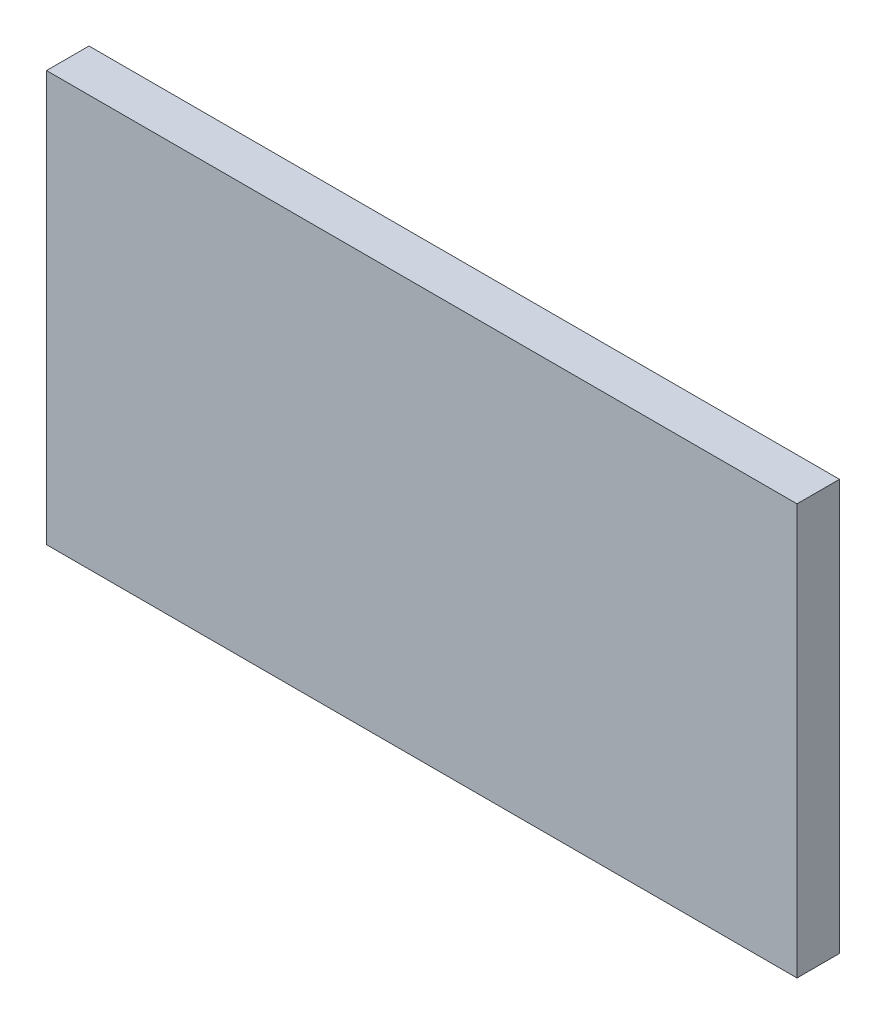
ISO-10303-21;
HEADER;
FILE_DESCRIPTION(('STEP AP214'),'2;1');
FILE_NAME('part.step','',(''),(''),'','','');
FILE_SCHEMA(('AUTOMOTIVE_DESIGN { 1 0 10303 214 1 1 1 1 }'));
ENDSEC;
DATA;
#1=APPLICATION_CONTEXT('core data for automotive mechanical design processes');
#2=APPLICATION_PROTOCOL_DEFINITION('international standard','automotive_design',2000,#1);
#3=PRODUCT_CONTEXT('',#1,'mechanical');
#4=PRODUCT('Part','Part','',(#3));
#5=PRODUCT_RELATED_PRODUCT_CATEGORY('part','',(#4));
#6=PRODUCT_DEFINITION_FORMATION('','',#4);
#7=PRODUCT_DEFINITION_CONTEXT('part definition',#1,'design');
#8=PRODUCT_DEFINITION('design','',#6,#7);
#9=PRODUCT_DEFINITION_SHAPE('','',#8);
#10=(LENGTH_UNIT() NAMED_UNIT(*) SI_UNIT(.MILLI.,.METRE.));
#11=(NAMED_UNIT(*) PLANE_ANGLE_UNIT() SI_UNIT($,.RADIAN.));
#12=(NAMED_UNIT(*) SI_UNIT($,.STERADIAN.) SOLID_ANGLE_UNIT());
#13=UNCERTAINTY_MEASURE_WITH_UNIT(LENGTH_MEASURE(1.E-05),#10,'distance_accuracy_value','');
#14=(GEOMETRIC_REPRESENTATION_CONTEXT(3) GLOBAL_UNCERTAINTY_ASSIGNED_CONTEXT((#13)) GLOBAL_UNIT_ASSIGNED_CONTEXT((#10,
#11,#12)) REPRESENTATION_CONTEXT('',''));
#15=CARTESIAN_POINT('',(0.,0.,0.));
#16=DIRECTION('',(0.,0.,1.));
#17=DIRECTION('',(1.,0.,0.));
#18=AXIS2_PLACEMENT_3D('',#15,#16,#17);
#19=CARTESIAN_POINT('',(-507.247231154465,-467.812739889184,205.549070426638));
#20=DIRECTION('',(1.,0.,0.));
#21=DIRECTION('',(0.,0.,-1.));
#22=AXIS2_PLACEMENT_3D('',#19,#20,#21);
#23=PLANE('',#22);
#24=DIRECTION('',(0.,-1.,0.));
#25=VECTOR('',#24,1.);
#26=CARTESIAN_POINT('',(-507.247231154465,-467.812739889184,204.787070426638));
#27=LINE('',#26,#25);
#28=CARTESIAN_POINT('',(-507.247231154465,-467.812739889184,204.787070426638));
#29=VERTEX_POINT('',#28);
#30=CARTESIAN_POINT('',(-507.247231154462,-475.178739889184,204.787070426638));
#31=VERTEX_POINT('',#30);
#32=EDGE_CURVE('E95',#29,#31,#27,.T.);
#33=ORIENTED_EDGE('',*,*,#32,.T.);
#34=DIRECTION('',(0.,0.,-1.));
#35=VECTOR('',#34,1.);
#36=CARTESIAN_POINT('',(-507.247231154462,-475.178739889184,205.549070426638));
#37=LINE('',#36,#35);
#38=CARTESIAN_POINT('',(-507.247231154462,-475.178739889184,205.549070426638));
#39=VERTEX_POINT('',#38);
#40=EDGE_CURVE('E11',#39,#31,#37,.T.);
#41=ORIENTED_EDGE('',*,*,#40,.F.);
#42=DIRECTION('',(0.,-1.,0.));
#43=VECTOR('',#42,1.);
#44=CARTESIAN_POINT('',(-507.247231154465,-467.812739889184,205.549070426638));
#45=LINE('',#44,#43);
#46=CARTESIAN_POINT('',(-507.247231154465,-467.812739889184,205.549070426638));
#47=VERTEX_POINT('',#46);
#48=EDGE_CURVE('E83',#47,#39,#45,.T.);
#49=ORIENTED_EDGE('',*,*,#48,.F.);
#50=DIRECTION('',(0.,0.,-1.));
#51=VECTOR('',#50,1.);
#52=CARTESIAN_POINT('',(-507.247231154465,-467.812739889184,205.549070426638));
#53=LINE('',#52,#51);
#54=EDGE_CURVE('E91',#47,#29,#53,.T.);
#55=ORIENTED_EDGE('',*,*,#54,.T.);
#56=EDGE_LOOP('',(#33,#41,#49,#55));
#57=FACE_BOUND('',#56,.T.);
#58=ADVANCED_FACE('F32',(#57),#23,.F.);
#59=CARTESIAN_POINT('',(-507.247231154462,-475.178739889184,205.549070426638));
#60=DIRECTION('',(0.,1.,0.));
#61=DIRECTION('',(0.,0.,1.));
#62=AXIS2_PLACEMENT_3D('',#59,#60,#61);
#63=PLANE('',#62);
#64=DIRECTION('',(1.,0.,0.));
#65=VECTOR('',#64,1.);
#66=CARTESIAN_POINT('',(-507.247231154462,-475.178739889184,204.787070426638));
#67=LINE('',#66,#65);
#68=CARTESIAN_POINT('',(-493.785231154467,-475.178739889182,204.787070426638));
#69=VERTEX_POINT('',#68);
#70=EDGE_CURVE('E87',#31,#69,#67,.T.);
#71=ORIENTED_EDGE('',*,*,#70,.T.);
#72=DIRECTION('',(0.,0.,-1.));
#73=VECTOR('',#72,1.);
#74=CARTESIAN_POINT('',(-493.785231154467,-475.178739889182,205.549070426638));
#75=LINE('',#74,#73);
#76=CARTESIAN_POINT('',(-493.785231154467,-475.178739889182,205.549070426638));
#77=VERTEX_POINT('',#76);
#78=EDGE_CURVE('E40',#77,#69,#75,.T.);
#79=ORIENTED_EDGE('',*,*,#78,.F.);
#80=DIRECTION('',(1.,0.,0.));
#81=VECTOR('',#80,1.);
#82=CARTESIAN_POINT('',(-507.247231154462,-475.178739889184,205.549070426638));
#83=LINE('',#82,#81);
#84=EDGE_CURVE('E78',#39,#77,#83,.T.);
#85=ORIENTED_EDGE('',*,*,#84,.F.);
#86=ORIENTED_EDGE('',*,*,#40,.T.);
#87=EDGE_LOOP('',(#71,#79,#85,#86));
#88=FACE_BOUND('',#87,.T.);
#89=ADVANCED_FACE('F86',(#88),#63,.F.);
#90=CARTESIAN_POINT('',(-493.785231154465,-467.812739889182,205.549070426638));
#91=DIRECTION('',(-1.,0.,0.));
#92=DIRECTION('',(0.,0.,1.));
#93=AXIS2_PLACEMENT_3D('',#90,#91,#92);
#94=PLANE('',#93);
#95=DIRECTION('',(0.,1.,0.));
#96=VECTOR('',#95,1.);
#97=CARTESIAN_POINT('',(-493.785231154465,-467.812739889182,204.787070426638));
#98=LINE('',#97,#96);
#99=CARTESIAN_POINT('',(-493.785231154465,-467.812739889182,204.787070426638));
#100=VERTEX_POINT('',#99);
#101=EDGE_CURVE('E65',#69,#100,#98,.T.);
#102=ORIENTED_EDGE('',*,*,#101,.T.);
#103=DIRECTION('',(0.,0.,-1.));
#104=VECTOR('',#103,1.);
#105=CARTESIAN_POINT('',(-493.785231154465,-467.812739889182,205.549070426638));
#106=LINE('',#105,#104);
#107=CARTESIAN_POINT('',(-493.785231154465,-467.812739889182,205.549070426638));
#108=VERTEX_POINT('',#107);
#109=EDGE_CURVE('E88',#108,#100,#106,.T.);
#110=ORIENTED_EDGE('',*,*,#109,.F.);
#111=DIRECTION('',(0.,1.,0.));
#112=VECTOR('',#111,1.);
#113=CARTESIAN_POINT('',(-493.785231154465,-467.812739889182,205.549070426638));
#114=LINE('',#113,#112);
#115=EDGE_CURVE('E81',#77,#108,#114,.T.);
#116=ORIENTED_EDGE('',*,*,#115,.F.);
#117=ORIENTED_EDGE('',*,*,#78,.T.);
#118=EDGE_LOOP('',(#102,#110,#116,#117));
#119=FACE_BOUND('',#118,.T.);
#120=ADVANCED_FACE('F89',(#119),#94,.F.);
#121=CARTESIAN_POINT('',(-507.247231154465,-467.812739889184,205.549070426638));
#122=DIRECTION('',(0.,-1.,0.));
#123=DIRECTION('',(0.,0.,-1.));
#124=AXIS2_PLACEMENT_3D('',#121,#122,#123);
#125=PLANE('',#124);
#126=DIRECTION('',(-1.,0.,0.));
#127=VECTOR('',#126,1.);
#128=CARTESIAN_POINT('',(-507.247231154465,-467.812739889184,204.787070426638));
#129=LINE('',#128,#127);
#130=EDGE_CURVE('E71',#100,#29,#129,.T.);
#131=ORIENTED_EDGE('',*,*,#130,.T.);
#132=ORIENTED_EDGE('',*,*,#54,.F.);
#133=DIRECTION('',(-1.,0.,0.));
#134=VECTOR('',#133,1.);
#135=CARTESIAN_POINT('',(-507.247231154465,-467.812739889184,205.549070426638));
#136=LINE('',#135,#134);
#137=EDGE_CURVE('E48',#108,#47,#136,.T.);
#138=ORIENTED_EDGE('',*,*,#137,.F.);
#139=ORIENTED_EDGE('',*,*,#109,.T.);
#140=EDGE_LOOP('',(#131,#132,#138,#139));
#141=FACE_BOUND('',#140,.T.);
#142=ADVANCED_FACE('F102',(#141),#125,.F.);
#143=CARTESIAN_POINT('',(0.,-2.72004641033163E-12,205.549070426638));
#144=DIRECTION('',(0.,0.,1.));
#145=DIRECTION('',(1.,0.,0.));
#146=AXIS2_PLACEMENT_3D('',#143,#144,#145);
#147=PLANE('',#146);
#148=ORIENTED_EDGE('',*,*,#48,.T.);
#149=ORIENTED_EDGE('',*,*,#84,.T.);
#150=ORIENTED_EDGE('',*,*,#115,.T.);
#151=ORIENTED_EDGE('',*,*,#137,.T.);
#152=EDGE_LOOP('',(#148,#149,#150,#151));
#153=FACE_BOUND('',#152,.T.);
#154=ADVANCED_FACE('F79',(#153),#147,.T.);
#155=CARTESIAN_POINT('',(0.,-2.72004641033163E-12,204.787070426638));
#156=DIRECTION('',(0.,0.,1.));
#157=DIRECTION('',(1.,0.,0.));
#158=AXIS2_PLACEMENT_3D('',#155,#156,#157);
#159=PLANE('',#158);
#160=ORIENTED_EDGE('',*,*,#32,.F.);
#161=ORIENTED_EDGE('',*,*,#130,.F.);
#162=ORIENTED_EDGE('',*,*,#101,.F.);
#163=ORIENTED_EDGE('',*,*,#70,.F.);
#164=EDGE_LOOP('',(#160,#161,#162,#163));
#165=FACE_BOUND('',#164,.T.);
#166=ADVANCED_FACE('F105',(#165),#159,.F.);
#167=CLOSED_SHELL('',(#58,#89,#120,#142,#154,#166));
#168=MANIFOLD_SOLID_BREP('B2',#167);
#169=ADVANCED_BREP_SHAPE_REPRESENTATION('',(#18,#168),#14);
#170=SHAPE_DEFINITION_REPRESENTATION(#9,#169);
ENDSEC;
END-ISO-10303-21;
